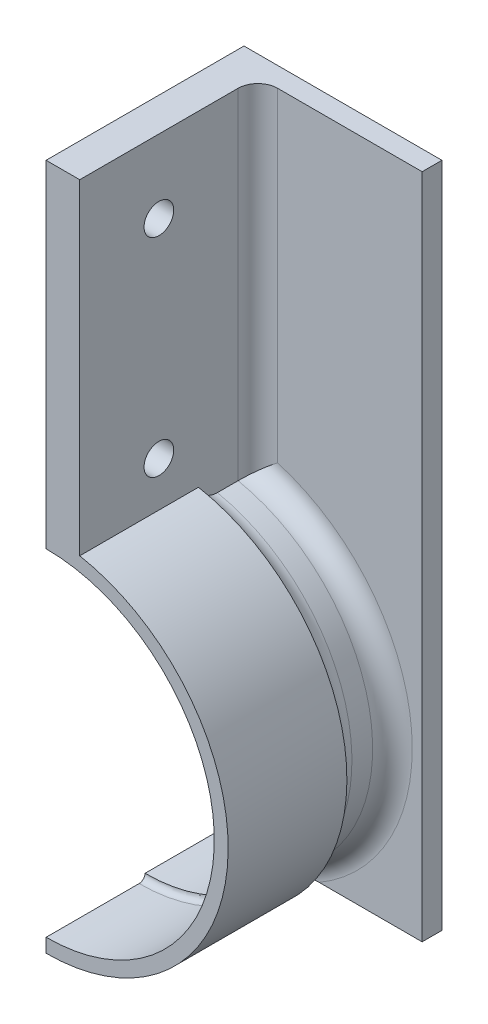
ISO-10303-21;
HEADER;
FILE_DESCRIPTION(('STEP AP214'),'2;1');
FILE_NAME('part.step','',(''),(''),'','','');
FILE_SCHEMA(('AUTOMOTIVE_DESIGN { 1 0 10303 214 1 1 1 1 }'));
ENDSEC;
DATA;
#1=APPLICATION_CONTEXT('core data for automotive mechanical design processes');
#2=APPLICATION_PROTOCOL_DEFINITION('international standard','automotive_design',2000,#1);
#3=PRODUCT_CONTEXT('',#1,'mechanical');
#4=PRODUCT('Part','Part','',(#3));
#5=PRODUCT_RELATED_PRODUCT_CATEGORY('part','',(#4));
#6=PRODUCT_DEFINITION_FORMATION('','',#4);
#7=PRODUCT_DEFINITION_CONTEXT('part definition',#1,'design');
#8=PRODUCT_DEFINITION('design','',#6,#7);
#9=PRODUCT_DEFINITION_SHAPE('','',#8);
#10=(LENGTH_UNIT() NAMED_UNIT(*) SI_UNIT(.MILLI.,.METRE.));
#11=(NAMED_UNIT(*) PLANE_ANGLE_UNIT() SI_UNIT($,.RADIAN.));
#12=(NAMED_UNIT(*) SI_UNIT($,.STERADIAN.) SOLID_ANGLE_UNIT());
#13=UNCERTAINTY_MEASURE_WITH_UNIT(LENGTH_MEASURE(1.E-05),#10,'distance_accuracy_value','');
#14=(GEOMETRIC_REPRESENTATION_CONTEXT(3) GLOBAL_UNCERTAINTY_ASSIGNED_CONTEXT((#13)) GLOBAL_UNIT_ASSIGNED_CONTEXT((#10,
#11,#12)) REPRESENTATION_CONTEXT('',''));
#15=CARTESIAN_POINT('',(0.,0.,0.));
#16=DIRECTION('',(0.,0.,1.));
#17=DIRECTION('',(1.,0.,0.));
#18=AXIS2_PLACEMENT_3D('',#15,#16,#17);
#19=CARTESIAN_POINT('',(25.4,20.828,12.7));
#20=DIRECTION('',(0.,0.,-1.));
#21=DIRECTION('',(-1.,0.,0.));
#22=AXIS2_PLACEMENT_3D('',#19,#20,#21);
#23=CYLINDRICAL_SURFACE('',#22,21.59);
#24=DIRECTION('',(0.,0.,-1.));
#25=VECTOR('',#24,1.);
#26=CARTESIAN_POINT('',(29.718,41.9817934186755,25.4));
#27=LINE('',#26,#25);
#28=CARTESIAN_POINT('',(29.718,41.9817934186755,7.73699442840096));
#29=VERTEX_POINT('',#28);
#30=CARTESIAN_POINT('',(29.718,41.9817934186755,5.08));
#31=VERTEX_POINT('',#30);
#32=EDGE_CURVE('E188',#29,#31,#27,.T.);
#33=ORIENTED_EDGE('',*,*,#32,.F.);
#34=CARTESIAN_POINT('',(25.4,20.828,7.73699442840096));
#35=DIRECTION('',(0.,0.,1.));
#36=DIRECTION('',(1.,0.,0.));
#37=AXIS2_PLACEMENT_3D('',#34,#35,#36);
#38=CIRCLE('',#37,21.59);
#39=CARTESIAN_POINT('',(25.4,-0.762000000000009,7.73699442840096));
#40=VERTEX_POINT('',#39);
#41=EDGE_CURVE('E360',#29,#40,#38,.F.);
#42=ORIENTED_EDGE('',*,*,#41,.T.);
#43=DIRECTION('',(0.,0.,-1.));
#44=VECTOR('',#43,1.);
#45=CARTESIAN_POINT('',(25.4,-0.762000000000009,12.7));
#46=LINE('',#45,#44);
#47=CARTESIAN_POINT('',(25.4,-0.762000000000009,0.));
#48=VERTEX_POINT('',#47);
#49=EDGE_CURVE('E234',#40,#48,#46,.T.);
#50=ORIENTED_EDGE('',*,*,#49,.T.);
#51=CARTESIAN_POINT('',(25.4,20.828,0.));
#52=DIRECTION('',(0.,0.,1.));
#53=DIRECTION('',(1.,0.,0.));
#54=AXIS2_PLACEMENT_3D('',#51,#52,#53);
#55=CIRCLE('',#54,21.59);
#56=CARTESIAN_POINT('',(31.0852894385423,0.,0.));
#57=VERTEX_POINT('',#56);
#58=EDGE_CURVE('E227',#48,#57,#55,.T.);
#59=ORIENTED_EDGE('',*,*,#58,.T.);
#60=DIRECTION('',(0.,0.,-1.));
#61=VECTOR('',#60,1.);
#62=CARTESIAN_POINT('',(31.0852894385423,0.,2.54));
#63=LINE('',#62,#61);
#64=CARTESIAN_POINT('',(31.0852894385423,0.,5.08));
#65=VERTEX_POINT('',#64);
#66=EDGE_CURVE('E269',#65,#57,#63,.T.);
#67=ORIENTED_EDGE('',*,*,#66,.F.);
#68=CARTESIAN_POINT('',(25.4,20.828,5.08));
#69=DIRECTION('',(0.,0.,1.));
#70=DIRECTION('',(1.,0.,0.));
#71=AXIS2_PLACEMENT_3D('',#68,#69,#70);
#72=CIRCLE('',#71,21.59);
#73=EDGE_CURVE('E273',#65,#31,#72,.T.);
#74=ORIENTED_EDGE('',*,*,#73,.T.);
#75=EDGE_LOOP('',(#33,#42,#50,#59,#67,#74));
#76=FACE_BOUND('',#75,.T.);
#77=ADVANCED_FACE('F57',(#76),#23,.T.);
#78=CARTESIAN_POINT('',(0.,0.,2.54));
#79=DIRECTION('',(0.,-1.,0.));
#80=DIRECTION('',(1.,0.,0.));
#81=AXIS2_PLACEMENT_3D('',#78,#79,#80);
#82=PLANE('',#81);
#83=DIRECTION('',(-1.,0.,0.));
#84=VECTOR('',#83,1.);
#85=CARTESIAN_POINT('',(0.,0.,0.));
#86=LINE('',#85,#84);
#87=CARTESIAN_POINT('',(50.8,0.,0.));
#88=VERTEX_POINT('',#87);
#89=EDGE_CURVE('E240',#88,#57,#86,.T.);
#90=ORIENTED_EDGE('',*,*,#89,.F.);
#91=DIRECTION('',(0.,0.,-1.));
#92=VECTOR('',#91,1.);
#93=CARTESIAN_POINT('',(50.8,0.,2.54));
#94=LINE('',#93,#92);
#95=CARTESIAN_POINT('',(50.8,0.,2.54));
#96=VERTEX_POINT('',#95);
#97=EDGE_CURVE('E266',#96,#88,#94,.T.);
#98=ORIENTED_EDGE('',*,*,#97,.F.);
#99=DIRECTION('',(-1.,0.,0.));
#100=VECTOR('',#99,1.);
#101=CARTESIAN_POINT('',(0.,0.,2.54));
#102=LINE('',#101,#100);
#103=CARTESIAN_POINT('',(37.5840599144949,0.,2.54));
#104=VERTEX_POINT('',#103);
#105=EDGE_CURVE('E241',#96,#104,#102,.T.);
#106=ORIENTED_EDGE('',*,*,#105,.T.);
#107=CARTESIAN_POINT('',(37.5840599144949,0.,2.54));
#108=CARTESIAN_POINT('',(37.4176967580642,0.,2.54002407059406));
#109=CARTESIAN_POINT('',(37.2513638373727,0.,2.54416675038596));
#110=CARTESIAN_POINT('',(36.9191081361267,0.,2.56010376706075));
#111=CARTESIAN_POINT('',(36.7531852521574,0.,2.57189592203051));
#112=CARTESIAN_POINT('',(36.4219315890537,0.,2.6025537166586));
#113=CARTESIAN_POINT('',(36.2566011009432,0.,2.62142245081183));
#114=CARTESIAN_POINT('',(35.92682549381,0.,2.66580794555206));
#115=CARTESIAN_POINT('',(35.7623804437359,0.,2.69132521642981));
#116=CARTESIAN_POINT('',(35.4348121931445,0.,2.74865144751826));
#117=CARTESIAN_POINT('',(35.2716875634179,0.,2.78045226543716));
#118=CARTESIAN_POINT('',(34.9467512718458,0.,2.85017426252131));
#119=CARTESIAN_POINT('',(34.7849396159099,0.,2.88809546921806));
#120=CARTESIAN_POINT('',(34.4629336873061,0.,2.96998801711861));
#121=CARTESIAN_POINT('',(34.3027387102494,0.,3.01395658947062));
#122=CARTESIAN_POINT('',(33.9841909007096,0.,3.10807656737236));
#123=CARTESIAN_POINT('',(33.8258378003098,0.,3.15822706108278));
#124=CARTESIAN_POINT('',(33.5844250848955,0.,3.24026866973817));
#125=CARTESIAN_POINT('',(33.5005652465513,0.,3.26981790499585));
#126=CARTESIAN_POINT('',(33.3335846097119,0.,3.33090396246121));
#127=CARTESIAN_POINT('',(33.2504637212044,0.,3.36244053869548));
#128=CARTESIAN_POINT('',(33.0022815550943,0.,3.46025636363336));
#129=CARTESIAN_POINT('',(32.8384583470845,0.,3.52972235975308));
#130=CARTESIAN_POINT('',(32.5251690534712,0.,3.67446124011205));
#131=CARTESIAN_POINT('',(32.3754315840688,0.,3.74913488757589));
#132=CARTESIAN_POINT('',(32.1558169775345,0.,3.87017218178491));
#133=CARTESIAN_POINT('',(32.0834527060279,0.,3.91201666854606));
#134=CARTESIAN_POINT('',(31.9409693386891,0.,3.99934858871018));
#135=CARTESIAN_POINT('',(31.8708494371806,0.,4.04483469385302));
#136=CARTESIAN_POINT('',(31.7268834921208,0.,4.14507892953177));
#137=CARTESIAN_POINT('',(31.6533628660681,0.,4.20030934335673));
#138=CARTESIAN_POINT('',(31.5121572191834,0.,4.31795298501494));
#139=CARTESIAN_POINT('',(31.4444684361928,0.,4.38036152058591));
#140=CARTESIAN_POINT('',(31.3410930380574,0.,4.49138892796041));
#141=CARTESIAN_POINT('',(31.3024712903756,0.,4.53724036643032));
#142=CARTESIAN_POINT('',(31.2317899237751,0.,4.63381573169035));
#143=CARTESIAN_POINT('',(31.1997190219209,0.,4.68453105580778));
#144=CARTESIAN_POINT('',(31.1532647560149,0.,4.77579606399541));
#145=CARTESIAN_POINT('',(31.136446559988,0.,4.8150900719681));
#146=CARTESIAN_POINT('',(31.1094202577423,0.,4.89585249420401));
#147=CARTESIAN_POINT('',(31.0991909168874,0.,4.93731345295458));
#148=CARTESIAN_POINT('',(31.0903577626122,0.,4.99597055913856));
#149=CARTESIAN_POINT('',(31.0884636901774,0.,5.01270652210177));
#150=CARTESIAN_POINT('',(31.0859279227728,0.,5.04629205028491));
#151=CARTESIAN_POINT('',(31.0852876630417,0.,5.06314172356526));
#152=CARTESIAN_POINT('',(31.0852894385431,0.,5.08000000000012));
#153=B_SPLINE_CURVE_WITH_KNOTS('',3,(#107,#108,#109,#110,#111,#112,#113,#114,#115,#116,#117,
#118,#119,#120,#121,#122,#123,#124,#125,#126,#127,#128,#129,#130,#131,#132,#133,#134,#135,#136,
#137,#138,#139,#140,#141,#142,#143,#144,#145,#146,#147,#148,#149,#150,#151,#152),.UNSPECIFIED.,
.F.,.F.,(4,2,2,2,2,2,2,2,2,2,2,2,2,2,2,2,2,2,2,2,2,2,4),(0.,0.498995224111989,0.997848178884856,
1.49691953031494,1.99602919792894,2.49449630558214,2.99296565556602,3.49120753106128,
3.98937600314549,4.2560946205508,4.52278029075546,5.05633363075435,5.5578456376388,
5.8085394726546,6.05914228146465,6.33472813099437,6.61013484598624,6.78962284467556,
6.96879904349882,7.09659100022738,7.22396901921171,7.27445756251079,7.32500386630806),.UNSPECIFIED.);
#154=EDGE_CURVE('E286',#104,#65,#153,.T.);
#155=ORIENTED_EDGE('',*,*,#154,.T.);
#156=ORIENTED_EDGE('',*,*,#66,.T.);
#157=EDGE_LOOP('',(#90,#98,#106,#155,#156));
#158=FACE_BOUND('',#157,.T.);
#159=ADVANCED_FACE('F301',(#158),#82,.T.);
#160=CARTESIAN_POINT('',(50.8,0.,2.54));
#161=DIRECTION('',(1.,0.,0.));
#162=DIRECTION('',(0.,1.,0.));
#163=AXIS2_PLACEMENT_3D('',#160,#161,#162);
#164=PLANE('',#163);
#165=DIRECTION('',(0.,-1.,0.));
#166=VECTOR('',#165,1.);
#167=CARTESIAN_POINT('',(50.8,0.,0.));
#168=LINE('',#167,#166);
#169=CARTESIAN_POINT('',(50.8,85.598,0.));
#170=VERTEX_POINT('',#169);
#171=EDGE_CURVE('E257',#170,#88,#168,.T.);
#172=ORIENTED_EDGE('',*,*,#171,.F.);
#173=DIRECTION('',(0.,0.,-1.));
#174=VECTOR('',#173,1.);
#175=CARTESIAN_POINT('',(50.8,85.598,2.54));
#176=LINE('',#175,#174);
#177=CARTESIAN_POINT('',(50.8,85.598,2.54));
#178=VERTEX_POINT('',#177);
#179=EDGE_CURVE('E253',#178,#170,#176,.T.);
#180=ORIENTED_EDGE('',*,*,#179,.F.);
#181=DIRECTION('',(0.,-1.,0.));
#182=VECTOR('',#181,1.);
#183=CARTESIAN_POINT('',(50.8,0.,2.54));
#184=LINE('',#183,#182);
#185=EDGE_CURVE('E245',#178,#96,#184,.T.);
#186=ORIENTED_EDGE('',*,*,#185,.T.);
#187=ORIENTED_EDGE('',*,*,#97,.T.);
#188=EDGE_LOOP('',(#172,#180,#186,#187));
#189=FACE_BOUND('',#188,.T.);
#190=ADVANCED_FACE('F305',(#189),#164,.T.);
#191=CARTESIAN_POINT('',(0.,85.598,2.54));
#192=DIRECTION('',(0.,1.,0.));
#193=DIRECTION('',(0.,0.,1.));
#194=AXIS2_PLACEMENT_3D('',#191,#192,#193);
#195=PLANE('',#194);
#196=DIRECTION('',(1.,0.,0.));
#197=VECTOR('',#196,1.);
#198=CARTESIAN_POINT('',(0.,85.598,0.));
#199=LINE('',#198,#197);
#200=CARTESIAN_POINT('',(25.4,85.598,0.));
#201=VERTEX_POINT('',#200);
#202=EDGE_CURVE('E246',#201,#170,#199,.T.);
#203=ORIENTED_EDGE('',*,*,#202,.F.);
#204=DIRECTION('',(0.,0.,-1.));
#205=VECTOR('',#204,1.);
#206=CARTESIAN_POINT('',(25.4,85.598,25.4));
#207=LINE('',#206,#205);
#208=CARTESIAN_POINT('',(25.4,85.598,25.4));
#209=VERTEX_POINT('',#208);
#210=EDGE_CURVE('E414',#209,#201,#207,.T.);
#211=ORIENTED_EDGE('',*,*,#210,.F.);
#212=DIRECTION('',(1.,0.,0.));
#213=VECTOR('',#212,1.);
#214=CARTESIAN_POINT('',(0.,85.598,25.4));
#215=LINE('',#214,#213);
#216=CARTESIAN_POINT('',(29.718,85.598,25.4));
#217=VERTEX_POINT('',#216);
#218=EDGE_CURVE('E178',#209,#217,#215,.T.);
#219=ORIENTED_EDGE('',*,*,#218,.T.);
#220=DIRECTION('',(0.,0.,-1.));
#221=VECTOR('',#220,1.);
#222=CARTESIAN_POINT('',(29.718,85.598,25.4));
#223=LINE('',#222,#221);
#224=CARTESIAN_POINT('',(29.718,85.598,5.08));
#225=VERTEX_POINT('',#224);
#226=EDGE_CURVE('E195',#217,#225,#223,.T.);
#227=ORIENTED_EDGE('',*,*,#226,.T.);
#228=CARTESIAN_POINT('',(32.258,85.598,5.08));
#229=DIRECTION('',(0.,1.,0.));
#230=DIRECTION('',(0.,0.,1.));
#231=AXIS2_PLACEMENT_3D('',#228,#229,#230);
#232=CIRCLE('',#231,2.54);
#233=CARTESIAN_POINT('',(32.258,85.598,2.54));
#234=VERTEX_POINT('',#233);
#235=EDGE_CURVE('E296',#225,#234,#232,.F.);
#236=ORIENTED_EDGE('',*,*,#235,.T.);
#237=DIRECTION('',(1.,0.,0.));
#238=VECTOR('',#237,1.);
#239=CARTESIAN_POINT('',(0.,85.598,2.54));
#240=LINE('',#239,#238);
#241=EDGE_CURVE('E250',#234,#178,#240,.T.);
#242=ORIENTED_EDGE('',*,*,#241,.T.);
#243=ORIENTED_EDGE('',*,*,#179,.T.);
#244=EDGE_LOOP('',(#203,#211,#219,#227,#236,#242,#243));
#245=FACE_BOUND('',#244,.T.);
#246=ADVANCED_FACE('F309',(#245),#195,.T.);
#247=CARTESIAN_POINT('',(0.,0.,2.54));
#248=DIRECTION('',(0.,0.,1.));
#249=DIRECTION('',(1.,0.,0.));
#250=AXIS2_PLACEMENT_3D('',#247,#248,#249);
#251=PLANE('',#250);
#252=DIRECTION('',(0.,-1.,0.));
#253=VECTOR('',#252,1.);
#254=CARTESIAN_POINT('',(32.258,41.9817934186755,2.54));
#255=LINE('',#254,#253);
#256=CARTESIAN_POINT('',(32.258,43.9629245946469,2.54));
#257=VERTEX_POINT('',#256);
#258=EDGE_CURVE('E277',#234,#257,#255,.T.);
#259=ORIENTED_EDGE('',*,*,#258,.T.);
#260=CARTESIAN_POINT('',(25.4,20.828,2.54));
#261=DIRECTION('',(0.,0.,1.));
#262=DIRECTION('',(1.,0.,0.));
#263=AXIS2_PLACEMENT_3D('',#260,#261,#262);
#264=CIRCLE('',#263,24.13);
#265=EDGE_CURVE('E280',#257,#104,#264,.F.);
#266=ORIENTED_EDGE('',*,*,#265,.T.);
#267=ORIENTED_EDGE('',*,*,#105,.F.);
#268=ORIENTED_EDGE('',*,*,#185,.F.);
#269=ORIENTED_EDGE('',*,*,#241,.F.);
#270=EDGE_LOOP('',(#259,#266,#267,#268,#269));
#271=FACE_BOUND('',#270,.T.);
#272=ADVANCED_FACE('F313',(#271),#251,.T.);
#273=CARTESIAN_POINT('',(0.,0.,0.));
#274=DIRECTION('',(0.,0.,1.));
#275=DIRECTION('',(1.,0.,0.));
#276=AXIS2_PLACEMENT_3D('',#273,#274,#275);
#277=PLANE('',#276);
#278=DIRECTION('',(0.,-1.,0.));
#279=VECTOR('',#278,1.);
#280=CARTESIAN_POINT('',(25.4,0.,0.));
#281=LINE('',#280,#279);
#282=CARTESIAN_POINT('',(25.4,41.656,0.));
#283=VERTEX_POINT('',#282);
#284=EDGE_CURVE('E219',#201,#283,#281,.T.);
#285=ORIENTED_EDGE('',*,*,#284,.F.);
#286=ORIENTED_EDGE('',*,*,#202,.T.);
#287=ORIENTED_EDGE('',*,*,#171,.T.);
#288=ORIENTED_EDGE('',*,*,#89,.T.);
#289=ORIENTED_EDGE('',*,*,#58,.F.);
#290=DIRECTION('',(0.,-1.,0.));
#291=VECTOR('',#290,1.);
#292=CARTESIAN_POINT('',(25.4,0.,0.));
#293=LINE('',#292,#291);
#294=CARTESIAN_POINT('',(25.4,0.,0.));
#295=VERTEX_POINT('',#294);
#296=EDGE_CURVE('E223',#295,#48,#293,.T.);
#297=ORIENTED_EDGE('',*,*,#296,.F.);
#298=CARTESIAN_POINT('',(25.4,20.828,0.));
#299=DIRECTION('',(0.,0.,1.));
#300=DIRECTION('',(1.,0.,0.));
#301=AXIS2_PLACEMENT_3D('',#298,#299,#300);
#302=CIRCLE('',#301,20.828);
#303=EDGE_CURVE('E213',#295,#283,#302,.T.);
#304=ORIENTED_EDGE('',*,*,#303,.T.);
#305=EDGE_LOOP('',(#285,#286,#287,#288,#289,#297,#304));
#306=FACE_BOUND('',#305,.T.);
#307=ADVANCED_FACE('F315',(#306),#277,.F.);
#308=CARTESIAN_POINT('',(25.4,20.828,12.7));
#309=DIRECTION('',(0.,0.,-1.));
#310=DIRECTION('',(-1.,0.,0.));
#311=AXIS2_PLACEMENT_3D('',#308,#309,#310);
#312=CYLINDRICAL_SURFACE('',#311,20.828);
#313=ORIENTED_EDGE('',*,*,#303,.F.);
#314=DIRECTION('',(0.,0.,-1.));
#315=VECTOR('',#314,1.);
#316=CARTESIAN_POINT('',(25.4,0.,12.7));
#317=LINE('',#316,#315);
#318=CARTESIAN_POINT('',(25.4,0.,12.7));
#319=VERTEX_POINT('',#318);
#320=EDGE_CURVE('E237',#319,#295,#317,.T.);
#321=ORIENTED_EDGE('',*,*,#320,.F.);
#322=CARTESIAN_POINT('',(25.4,20.828,12.7));
#323=DIRECTION('',(0.,0.,1.));
#324=DIRECTION('',(1.,0.,0.));
#325=AXIS2_PLACEMENT_3D('',#322,#323,#324);
#326=CIRCLE('',#325,20.828);
#327=CARTESIAN_POINT('',(25.4,41.656,12.7));
#328=VERTEX_POINT('',#327);
#329=EDGE_CURVE('E214',#319,#328,#326,.T.);
#330=ORIENTED_EDGE('',*,*,#329,.T.);
#331=DIRECTION('',(0.,0.,-1.));
#332=VECTOR('',#331,1.);
#333=CARTESIAN_POINT('',(25.4,41.656,12.7));
#334=LINE('',#333,#332);
#335=EDGE_CURVE('E218',#328,#283,#334,.T.);
#336=ORIENTED_EDGE('',*,*,#335,.T.);
#337=EDGE_LOOP('',(#313,#321,#330,#336));
#338=FACE_BOUND('',#337,.T.);
#339=ADVANCED_FACE('F318',(#338),#312,.F.);
#340=CARTESIAN_POINT('',(25.4,0.,12.7));
#341=DIRECTION('',(1.,0.,0.));
#342=DIRECTION('',(0.,1.,0.));
#343=AXIS2_PLACEMENT_3D('',#340,#341,#342);
#344=PLANE('',#343);
#345=ORIENTED_EDGE('',*,*,#296,.T.);
#346=ORIENTED_EDGE('',*,*,#49,.F.);
#347=CARTESIAN_POINT('',(25.4,-3.30200000000001,7.73699442840096));
#348=DIRECTION('',(1.,0.,0.));
#349=DIRECTION('',(0.,1.,0.));
#350=AXIS2_PLACEMENT_3D('',#347,#348,#349);
#351=CIRCLE('',#350,2.54);
#352=CARTESIAN_POINT('',(25.4,-2.54,10.16));
#353=VERTEX_POINT('',#352);
#354=EDGE_CURVE('E386',#40,#353,#351,.T.);
#355=ORIENTED_EDGE('',*,*,#354,.T.);
#356=DIRECTION('',(0.,0.,-1.));
#357=VECTOR('',#356,1.);
#358=CARTESIAN_POINT('',(25.4,-2.54,25.4));
#359=LINE('',#358,#357);
#360=CARTESIAN_POINT('',(25.4,-2.54,25.4));
#361=VERTEX_POINT('',#360);
#362=EDGE_CURVE('E209',#361,#353,#359,.T.);
#363=ORIENTED_EDGE('',*,*,#362,.F.);
#364=DIRECTION('',(0.,-1.,0.));
#365=VECTOR('',#364,1.);
#366=CARTESIAN_POINT('',(25.4,0.,25.4));
#367=LINE('',#366,#365);
#368=CARTESIAN_POINT('',(25.4,-0.762000000000009,25.4));
#369=VERTEX_POINT('',#368);
#370=EDGE_CURVE('E193',#369,#361,#367,.T.);
#371=ORIENTED_EDGE('',*,*,#370,.F.);
#372=DIRECTION('',(0.,0.,-1.));
#373=VECTOR('',#372,1.);
#374=CARTESIAN_POINT('',(25.4,-0.762000000000009,25.4));
#375=LINE('',#374,#373);
#376=CARTESIAN_POINT('',(25.4,-0.762000000000009,13.462));
#377=VERTEX_POINT('',#376);
#378=EDGE_CURVE('E165',#369,#377,#375,.T.);
#379=ORIENTED_EDGE('',*,*,#378,.T.);
#380=CARTESIAN_POINT('',(25.4,0.,13.462));
#381=DIRECTION('',(1.,0.,0.));
#382=DIRECTION('',(0.,1.,0.));
#383=AXIS2_PLACEMENT_3D('',#380,#381,#382);
#384=CIRCLE('',#383,0.762);
#385=EDGE_CURVE('E13',#377,#319,#384,.T.);
#386=ORIENTED_EDGE('',*,*,#385,.T.);
#387=ORIENTED_EDGE('',*,*,#320,.T.);
#388=EDGE_LOOP('',(#345,#346,#355,#363,#371,#379,#386,#387));
#389=FACE_BOUND('',#388,.T.);
#390=ADVANCED_FACE('F325',(#389),#344,.F.);
#391=CARTESIAN_POINT('',(25.4,0.,12.7));
#392=DIRECTION('',(1.,0.,0.));
#393=DIRECTION('',(0.,1.,0.));
#394=AXIS2_PLACEMENT_3D('',#391,#392,#393);
#395=PLANE('',#394);
#396=CARTESIAN_POINT('',(25.4,76.2,15.24));
#397=DIRECTION('',(1.,0.,0.));
#398=DIRECTION('',(0.,1.,0.));
#399=AXIS2_PLACEMENT_3D('',#396,#397,#398);
#400=CIRCLE('',#399,1.905);
#401=CARTESIAN_POINT('',(25.4,76.2,17.145));
#402=VERTEX_POINT('',#401);
#403=EDGE_CURVE('E404',#402,#402,#400,.F.);
#404=ORIENTED_EDGE('',*,*,#403,.F.);
#405=EDGE_LOOP('',(#404));
#406=FACE_BOUND('',#405,.T.);
#407=CARTESIAN_POINT('',(25.4,49.53,15.24));
#408=DIRECTION('',(1.,0.,0.));
#409=DIRECTION('',(0.,1.,0.));
#410=AXIS2_PLACEMENT_3D('',#407,#408,#409);
#411=CIRCLE('',#410,1.905);
#412=CARTESIAN_POINT('',(25.4,49.53,17.145));
#413=VERTEX_POINT('',#412);
#414=EDGE_CURVE('E394',#413,#413,#411,.F.);
#415=ORIENTED_EDGE('',*,*,#414,.F.);
#416=EDGE_LOOP('',(#415));
#417=FACE_BOUND('',#416,.T.);
#418=ORIENTED_EDGE('',*,*,#284,.T.);
#419=ORIENTED_EDGE('',*,*,#335,.F.);
#420=CARTESIAN_POINT('',(25.4,41.656,13.462));
#421=DIRECTION('',(1.,0.,0.));
#422=DIRECTION('',(0.,1.,0.));
#423=AXIS2_PLACEMENT_3D('',#420,#421,#422);
#424=CIRCLE('',#423,0.762);
#425=CARTESIAN_POINT('',(25.4,42.418,13.462));
#426=VERTEX_POINT('',#425);
#427=EDGE_CURVE('E67',#328,#426,#424,.T.);
#428=ORIENTED_EDGE('',*,*,#427,.T.);
#429=DIRECTION('',(0.,0.,-1.));
#430=VECTOR('',#429,1.);
#431=CARTESIAN_POINT('',(25.4,42.418,25.4));
#432=LINE('',#431,#430);
#433=CARTESIAN_POINT('',(25.4,42.418,25.4));
#434=VERTEX_POINT('',#433);
#435=EDGE_CURVE('E164',#434,#426,#432,.T.);
#436=ORIENTED_EDGE('',*,*,#435,.F.);
#437=DIRECTION('',(0.,-1.,0.));
#438=VECTOR('',#437,1.);
#439=CARTESIAN_POINT('',(25.4,0.,25.4));
#440=LINE('',#439,#438);
#441=EDGE_CURVE('E174',#209,#434,#440,.T.);
#442=ORIENTED_EDGE('',*,*,#441,.F.);
#443=ORIENTED_EDGE('',*,*,#210,.T.);
#444=EDGE_LOOP('',(#418,#419,#428,#436,#442,#443));
#445=FACE_BOUND('',#444,.T.);
#446=ADVANCED_FACE('F185',(#406,#417,#445),#395,.F.);
#447=CARTESIAN_POINT('',(25.4,20.828,25.4));
#448=DIRECTION('',(0.,0.,-1.));
#449=DIRECTION('',(-1.,0.,0.));
#450=AXIS2_PLACEMENT_3D('',#447,#448,#449);
#451=CYLINDRICAL_SURFACE('',#450,23.368);
#452=CARTESIAN_POINT('',(25.4,20.828,10.16));
#453=DIRECTION('',(0.,0.,1.));
#454=DIRECTION('',(1.,0.,0.));
#455=AXIS2_PLACEMENT_3D('',#452,#453,#454);
#456=CIRCLE('',#455,23.368);
#457=CARTESIAN_POINT('',(29.718,43.7935894764319,10.16));
#458=VERTEX_POINT('',#457);
#459=EDGE_CURVE('E187',#353,#458,#456,.T.);
#460=ORIENTED_EDGE('',*,*,#459,.T.);
#461=DIRECTION('',(0.,0.,-1.));
#462=VECTOR('',#461,1.);
#463=CARTESIAN_POINT('',(29.718,43.7935894764319,25.4));
#464=LINE('',#463,#462);
#465=CARTESIAN_POINT('',(29.718,43.7935894764319,25.4));
#466=VERTEX_POINT('',#465);
#467=EDGE_CURVE('E205',#466,#458,#464,.T.);
#468=ORIENTED_EDGE('',*,*,#467,.F.);
#469=CARTESIAN_POINT('',(25.4,20.828,25.4));
#470=DIRECTION('',(0.,0.,1.));
#471=DIRECTION('',(1.,0.,0.));
#472=AXIS2_PLACEMENT_3D('',#469,#470,#471);
#473=CIRCLE('',#472,23.368);
#474=EDGE_CURVE('E170',#361,#466,#473,.T.);
#475=ORIENTED_EDGE('',*,*,#474,.F.);
#476=ORIENTED_EDGE('',*,*,#362,.T.);
#477=EDGE_LOOP('',(#460,#468,#475,#476));
#478=FACE_BOUND('',#477,.T.);
#479=ADVANCED_FACE('F335',(#478),#451,.T.);
#480=CARTESIAN_POINT('',(25.4,20.828,25.4));
#481=DIRECTION('',(0.,0.,-1.));
#482=DIRECTION('',(-1.,0.,0.));
#483=AXIS2_PLACEMENT_3D('',#480,#481,#482);
#484=CYLINDRICAL_SURFACE('',#483,21.59);
#485=ORIENTED_EDGE('',*,*,#435,.T.);
#486=CARTESIAN_POINT('',(25.4,20.828,13.462));
#487=DIRECTION('',(0.,0.,1.));
#488=DIRECTION('',(1.,0.,0.));
#489=AXIS2_PLACEMENT_3D('',#486,#487,#488);
#490=CIRCLE('',#489,21.59);
#491=EDGE_CURVE('E75',#426,#377,#490,.F.);
#492=ORIENTED_EDGE('',*,*,#491,.T.);
#493=ORIENTED_EDGE('',*,*,#378,.F.);
#494=CARTESIAN_POINT('',(25.4,20.828,25.4));
#495=DIRECTION('',(0.,0.,1.));
#496=DIRECTION('',(1.,0.,0.));
#497=AXIS2_PLACEMENT_3D('',#494,#495,#496);
#498=CIRCLE('',#497,21.59);
#499=EDGE_CURVE('E161',#369,#434,#498,.T.);
#500=ORIENTED_EDGE('',*,*,#499,.T.);
#501=EDGE_LOOP('',(#485,#492,#493,#500));
#502=FACE_BOUND('',#501,.T.);
#503=ADVANCED_FACE('F163',(#502),#484,.F.);
#504=CARTESIAN_POINT('',(0.,0.,25.4));
#505=DIRECTION('',(0.,0.,1.));
#506=DIRECTION('',(1.,0.,0.));
#507=AXIS2_PLACEMENT_3D('',#504,#505,#506);
#508=PLANE('',#507);
#509=ORIENTED_EDGE('',*,*,#370,.T.);
#510=ORIENTED_EDGE('',*,*,#474,.T.);
#511=DIRECTION('',(0.,-1.,0.));
#512=VECTOR('',#511,1.);
#513=CARTESIAN_POINT('',(29.718,0.,25.4));
#514=LINE('',#513,#512);
#515=EDGE_CURVE('E181',#217,#466,#514,.T.);
#516=ORIENTED_EDGE('',*,*,#515,.F.);
#517=ORIENTED_EDGE('',*,*,#218,.F.);
#518=ORIENTED_EDGE('',*,*,#441,.T.);
#519=ORIENTED_EDGE('',*,*,#499,.F.);
#520=EDGE_LOOP('',(#509,#510,#516,#517,#518,#519));
#521=FACE_BOUND('',#520,.T.);
#522=ADVANCED_FACE('F175',(#521),#508,.T.);
#523=CARTESIAN_POINT('',(29.718,0.,25.4));
#524=DIRECTION('',(1.,0.,0.));
#525=DIRECTION('',(0.,1.,0.));
#526=AXIS2_PLACEMENT_3D('',#523,#524,#525);
#527=PLANE('',#526);
#528=CARTESIAN_POINT('',(29.718,76.2,15.24));
#529=DIRECTION('',(1.,0.,0.));
#530=DIRECTION('',(0.,1.,0.));
#531=AXIS2_PLACEMENT_3D('',#528,#529,#530);
#532=CIRCLE('',#531,1.905);
#533=CARTESIAN_POINT('',(29.718,76.2,17.145));
#534=VERTEX_POINT('',#533);
#535=EDGE_CURVE('E61',#534,#534,#532,.F.);
#536=ORIENTED_EDGE('',*,*,#535,.T.);
#537=EDGE_LOOP('',(#536));
#538=FACE_BOUND('',#537,.T.);
#539=CARTESIAN_POINT('',(29.718,49.53,15.24));
#540=DIRECTION('',(1.,0.,0.));
#541=DIRECTION('',(0.,1.,0.));
#542=AXIS2_PLACEMENT_3D('',#539,#540,#541);
#543=CIRCLE('',#542,1.905);
#544=CARTESIAN_POINT('',(29.718,49.53,17.145));
#545=VERTEX_POINT('',#544);
#546=EDGE_CURVE('E391',#545,#545,#543,.F.);
#547=ORIENTED_EDGE('',*,*,#546,.T.);
#548=EDGE_LOOP('',(#547));
#549=FACE_BOUND('',#548,.T.);
#550=ORIENTED_EDGE('',*,*,#467,.T.);
#551=CARTESIAN_POINT('',(29.718,43.7935894764319,10.16));
#552=CARTESIAN_POINT('',(29.718,43.7238341165531,10.1384394505341));
#553=CARTESIAN_POINT('',(29.718,43.6550120300066,10.1139740655779));
#554=CARTESIAN_POINT('',(29.718,43.5196517108299,10.0593778736427));
#555=CARTESIAN_POINT('',(29.718,43.4531135238361,10.0292469535344));
#556=CARTESIAN_POINT('',(29.718,43.2576496789117,9.93062154828261));
#557=CARTESIAN_POINT('',(29.718,43.1327721346057,9.85386265375129));
#558=CARTESIAN_POINT('',(29.718,42.8976969763385,9.68038101166567));
#559=CARTESIAN_POINT('',(29.718,42.7875099915996,9.5836439366946));
#560=CARTESIAN_POINT('',(29.718,42.5852111418281,9.37285926301665));
#561=CARTESIAN_POINT('',(29.718,42.4930913640704,9.25881928128868));
#562=CARTESIAN_POINT('',(29.718,42.3307735875437,9.01806266937681));
#563=CARTESIAN_POINT('',(29.718,42.2603282137493,8.89151269029474));
#564=CARTESIAN_POINT('',(29.718,42.1421550946068,8.62820120245537));
#565=CARTESIAN_POINT('',(29.718,42.0944203859385,8.4914428385899));
#566=CARTESIAN_POINT('',(29.718,42.0332859484736,8.25127176642006));
#567=CARTESIAN_POINT('',(29.718,42.0140022580866,8.14931674197904));
#568=CARTESIAN_POINT('',(29.718,41.9882494253367,7.943921420764));
#569=CARTESIAN_POINT('',(29.718,41.9817655800415,7.84048296577162));
#570=CARTESIAN_POINT('',(29.718,41.9817934186755,7.73699442840096));
#571=B_SPLINE_CURVE_WITH_KNOTS('',3,(#551,#552,#553,#554,#555,#556,#557,#558,#559,#560,#561,
#562,#563,#564,#565,#566,#567,#568,#569,#570),.UNSPECIFIED.,.F.,.F.,(4,2,2,2,2,2,2,2,2,4),(0.,
0.21890247766688,0.437809326841313,0.875304854379786,1.31311522960884,1.75073343085556,
2.18315393515923,2.61544176936976,2.92596688046582,3.23613508939136),.UNSPECIFIED.);
#572=EDGE_CURVE('E353',#458,#29,#571,.T.);
#573=ORIENTED_EDGE('',*,*,#572,.T.);
#574=ORIENTED_EDGE('',*,*,#32,.T.);
#575=DIRECTION('',(0.,-1.,0.));
#576=VECTOR('',#575,1.);
#577=CARTESIAN_POINT('',(29.718,85.598,5.08));
#578=LINE('',#577,#576);
#579=EDGE_CURVE('E283',#31,#225,#578,.F.);
#580=ORIENTED_EDGE('',*,*,#579,.T.);
#581=ORIENTED_EDGE('',*,*,#226,.F.);
#582=ORIENTED_EDGE('',*,*,#515,.T.);
#583=EDGE_LOOP('',(#550,#573,#574,#580,#581,#582));
#584=FACE_BOUND('',#583,.T.);
#585=ADVANCED_FACE('F344',(#538,#549,#584),#527,.T.);
#586=CARTESIAN_POINT('',(32.258,0.,5.08));
#587=DIRECTION('',(0.,1.,0.));
#588=DIRECTION('',(-1.,0.,0.));
#589=AXIS2_PLACEMENT_3D('',#586,#587,#588);
#590=CYLINDRICAL_SURFACE('',#589,2.54);
#591=ORIENTED_EDGE('',*,*,#235,.F.);
#592=ORIENTED_EDGE('',*,*,#579,.F.);
#593=CARTESIAN_POINT('',(29.718,41.9817934186755,5.08));
#594=CARTESIAN_POINT('',(29.7179868525976,41.981781790478,5.01965116827999));
#595=CARTESIAN_POINT('',(29.7201503545004,41.9835491562669,4.9593115777802));
#596=CARTESIAN_POINT('',(29.7287294639266,41.9905527021619,4.83917343205825));
#597=CARTESIAN_POINT('',(29.7351425115944,41.9957867939693,4.7793745730768));
#598=CARTESIAN_POINT('',(29.7520609866859,42.0095868889027,4.66117711863565));
#599=CARTESIAN_POINT('',(29.762537780526,42.0181295786837,4.60277169591608));
#600=CARTESIAN_POINT('',(29.7873970452975,42.0383826027662,4.48737004851407));
#601=CARTESIAN_POINT('',(29.8017799278194,42.0500932708819,4.43037397302764));
#602=CARTESIAN_POINT('',(29.8503998738406,42.0896390212473,4.26231774671221));
#603=CARTESIAN_POINT('',(29.8901613840319,42.1219313703917,4.15383074717146));
#604=CARTESIAN_POINT('',(29.9823266012153,42.1965578433487,3.94602450485301));
#605=CARTESIAN_POINT('',(30.0347532842992,42.2389102148416,3.84672238250497));
#606=CARTESIAN_POINT('',(30.1687587108149,42.3467763154654,3.62811318456658));
#607=CARTESIAN_POINT('',(30.2542817806886,42.4153506553911,3.51272479171881));
#608=CARTESIAN_POINT('',(30.4392485365705,42.5628394863352,3.30136341188983));
#609=CARTESIAN_POINT('',(30.5387144641815,42.6417704851376,3.20542205690691));
#610=CARTESIAN_POINT('',(30.7741887251051,42.8275129084563,3.01151863236241));
#611=CARTESIAN_POINT('',(30.9131137400419,42.9363592327673,2.91905572106407));
#612=CARTESIAN_POINT('',(31.2017741118868,43.1607355784742,2.76421997714121));
#613=CARTESIAN_POINT('',(31.351514141322,43.2762684844113,2.70186024080032));
#614=CARTESIAN_POINT('',(31.625886878151,43.4862807619923,2.61663080498414));
#615=CARTESIAN_POINT('',(31.7493111506839,43.5801754113286,2.58826264444268));
#616=CARTESIAN_POINT('',(31.9983544997082,43.7684526654653,2.55017759076966));
#617=CARTESIAN_POINT('',(32.12396846743,43.8628338459796,2.54042196008685));
#618=CARTESIAN_POINT('',(32.2525009366138,43.9588188495121,2.54000446260977));
#619=CARTESIAN_POINT('',(32.2552504334122,43.9608718335589,2.53999999792227));
#620=CARTESIAN_POINT('',(32.258,43.9629245946469,2.54));
#621=B_SPLINE_CURVE_WITH_KNOTS('',3,(#593,#594,#595,#596,#597,#598,#599,#600,#601,#602,#603,
#604,#605,#606,#607,#608,#609,#610,#611,#612,#613,#614,#615,#616,#617,#618,#619,#620),
.UNSPECIFIED.,.F.,.F.,(4,2,2,2,2,2,2,2,2,2,2,2,2,4),(0.,0.18096671126668,0.361824510181028,
0.541430460908171,0.721055344339483,1.0792233224743,1.43804600365724,1.91293236744368,
2.38858507655304,2.98323376812747,3.5781409269643,4.05007282115772,4.52102142536176,
4.53131560728989),.UNSPECIFIED.);
#622=EDGE_CURVE('E182',#257,#31,#621,.F.);
#623=ORIENTED_EDGE('',*,*,#622,.F.);
#624=ORIENTED_EDGE('',*,*,#258,.F.);
#625=EDGE_LOOP('',(#591,#592,#623,#624));
#626=FACE_BOUND('',#625,.T.);
#627=ADVANCED_FACE('F348',(#626),#590,.F.);
#628=CARTESIAN_POINT('',(25.4,20.828,5.08));
#629=DIRECTION('',(0.,0.,1.));
#630=DIRECTION('',(1.,0.,0.));
#631=AXIS2_PLACEMENT_3D('',#628,#629,#630);
#632=TOROIDAL_SURFACE('',#631,24.13,2.54);
#633=ORIENTED_EDGE('',*,*,#154,.F.);
#634=ORIENTED_EDGE('',*,*,#265,.F.);
#635=ORIENTED_EDGE('',*,*,#622,.T.);
#636=ORIENTED_EDGE('',*,*,#73,.F.);
#637=EDGE_LOOP('',(#633,#634,#635,#636));
#638=FACE_BOUND('',#637,.T.);
#639=ADVANCED_FACE('F298',(#638),#632,.F.);
#640=CARTESIAN_POINT('',(25.4,20.828,7.73699442840096));
#641=DIRECTION('',(0.,0.,1.));
#642=DIRECTION('',(1.,0.,0.));
#643=AXIS2_PLACEMENT_3D('',#640,#641,#642);
#644=TOROIDAL_SURFACE('',#643,24.13,2.54);
#645=ORIENTED_EDGE('',*,*,#354,.F.);
#646=ORIENTED_EDGE('',*,*,#41,.F.);
#647=ORIENTED_EDGE('',*,*,#572,.F.);
#648=ORIENTED_EDGE('',*,*,#459,.F.);
#649=EDGE_LOOP('',(#645,#646,#647,#648));
#650=FACE_BOUND('',#649,.T.);
#651=ADVANCED_FACE('F366',(#650),#644,.F.);
#652=CARTESIAN_POINT('',(25.4,20.828,13.462));
#653=DIRECTION('',(0.,0.,1.));
#654=DIRECTION('',(1.,0.,0.));
#655=AXIS2_PLACEMENT_3D('',#652,#653,#654);
#656=TOROIDAL_SURFACE('',#655,20.828,0.762);
#657=ORIENTED_EDGE('',*,*,#385,.F.);
#658=ORIENTED_EDGE('',*,*,#491,.F.);
#659=ORIENTED_EDGE('',*,*,#427,.F.);
#660=ORIENTED_EDGE('',*,*,#329,.F.);
#661=EDGE_LOOP('',(#657,#658,#659,#660));
#662=FACE_BOUND('',#661,.T.);
#663=ADVANCED_FACE('F59',(#662),#656,.F.);
#664=CARTESIAN_POINT('',(50.8,49.53,15.24));
#665=DIRECTION('',(-1.,0.,0.));
#666=DIRECTION('',(0.,0.,1.));
#667=AXIS2_PLACEMENT_3D('',#664,#665,#666);
#668=CYLINDRICAL_SURFACE('',#667,1.905);
#669=CARTESIAN_POINT('',(29.718,49.53,17.145));
#670=CARTESIAN_POINT('',(29.6730208333333,49.53,17.145));
#671=CARTESIAN_POINT('',(29.6280416666667,49.53,17.145));
#672=CARTESIAN_POINT('',(29.5380833333333,49.53,17.145));
#673=CARTESIAN_POINT('',(29.4931041666667,49.53,17.145));
#674=CARTESIAN_POINT('',(29.4031458333333,49.53,17.145));
#675=CARTESIAN_POINT('',(29.3581666666667,49.53,17.145));
#676=CARTESIAN_POINT('',(29.2682083333333,49.53,17.145));
#677=CARTESIAN_POINT('',(29.2232291666667,49.53,17.145));
#678=CARTESIAN_POINT('',(29.1332708333333,49.53,17.145));
#679=CARTESIAN_POINT('',(29.0882916666667,49.53,17.145));
#680=CARTESIAN_POINT('',(28.9983333333333,49.53,17.145));
#681=CARTESIAN_POINT('',(28.9533541666667,49.53,17.145));
#682=CARTESIAN_POINT('',(28.8633958333333,49.53,17.145));
#683=CARTESIAN_POINT('',(28.8184166666667,49.53,17.145));
#684=CARTESIAN_POINT('',(28.7284583333333,49.53,17.145));
#685=CARTESIAN_POINT('',(28.6834791666667,49.53,17.145));
#686=CARTESIAN_POINT('',(28.5935208333333,49.53,17.145));
#687=CARTESIAN_POINT('',(28.5485416666667,49.53,17.145));
#688=CARTESIAN_POINT('',(28.4585833333333,49.53,17.145));
#689=CARTESIAN_POINT('',(28.4136041666667,49.53,17.145));
#690=CARTESIAN_POINT('',(28.3236458333333,49.53,17.145));
#691=CARTESIAN_POINT('',(28.2786666666667,49.53,17.145));
#692=CARTESIAN_POINT('',(28.1887083333333,49.53,17.145));
#693=CARTESIAN_POINT('',(28.1437291666667,49.53,17.145));
#694=CARTESIAN_POINT('',(28.0537708333333,49.53,17.145));
#695=CARTESIAN_POINT('',(28.0087916666667,49.53,17.145));
#696=CARTESIAN_POINT('',(27.9188333333333,49.53,17.145));
#697=CARTESIAN_POINT('',(27.8738541666667,49.53,17.145));
#698=CARTESIAN_POINT('',(27.7838958333333,49.53,17.145));
#699=CARTESIAN_POINT('',(27.7389166666667,49.53,17.145));
#700=CARTESIAN_POINT('',(27.6489583333333,49.53,17.145));
#701=CARTESIAN_POINT('',(27.6039791666667,49.53,17.145));
#702=CARTESIAN_POINT('',(27.5140208333333,49.53,17.145));
#703=CARTESIAN_POINT('',(27.4690416666667,49.53,17.145));
#704=CARTESIAN_POINT('',(27.3790833333333,49.53,17.145));
#705=CARTESIAN_POINT('',(27.3341041666667,49.53,17.145));
#706=CARTESIAN_POINT('',(27.2441458333333,49.53,17.145));
#707=CARTESIAN_POINT('',(27.1991666666667,49.53,17.145));
#708=CARTESIAN_POINT('',(27.1092083333333,49.53,17.145));
#709=CARTESIAN_POINT('',(27.0642291666667,49.53,17.145));
#710=CARTESIAN_POINT('',(26.9742708333333,49.53,17.145));
#711=CARTESIAN_POINT('',(26.9292916666667,49.53,17.145));
#712=CARTESIAN_POINT('',(26.8393333333333,49.53,17.145));
#713=CARTESIAN_POINT('',(26.7943541666667,49.53,17.145));
#714=CARTESIAN_POINT('',(26.7043958333333,49.53,17.145));
#715=CARTESIAN_POINT('',(26.6594166666667,49.53,17.145));
#716=CARTESIAN_POINT('',(26.5694583333333,49.53,17.145));
#717=CARTESIAN_POINT('',(26.5244791666667,49.53,17.145));
#718=CARTESIAN_POINT('',(26.4345208333333,49.53,17.145));
#719=CARTESIAN_POINT('',(26.3895416666667,49.53,17.145));
#720=CARTESIAN_POINT('',(26.2995833333333,49.53,17.145));
#721=CARTESIAN_POINT('',(26.2546041666667,49.53,17.145));
#722=CARTESIAN_POINT('',(26.1646458333333,49.53,17.145));
#723=CARTESIAN_POINT('',(26.1196666666667,49.53,17.145));
#724=CARTESIAN_POINT('',(26.0297083333333,49.53,17.145));
#725=CARTESIAN_POINT('',(25.9847291666667,49.53,17.145));
#726=CARTESIAN_POINT('',(25.8947708333333,49.53,17.145));
#727=CARTESIAN_POINT('',(25.8497916666667,49.53,17.145));
#728=CARTESIAN_POINT('',(25.7598333333333,49.53,17.145));
#729=CARTESIAN_POINT('',(25.7148541666667,49.53,17.145));
#730=CARTESIAN_POINT('',(25.6248958333333,49.53,17.145));
#731=CARTESIAN_POINT('',(25.5799166666667,49.53,17.145));
#732=CARTESIAN_POINT('',(25.4899583333333,49.53,17.145));
#733=CARTESIAN_POINT('',(25.4449791666667,49.53,17.145));
#734=CARTESIAN_POINT('',(25.4,49.53,17.145));
#735=B_SPLINE_CURVE_WITH_KNOTS('',3,(#669,#670,#671,#672,#673,#674,#675,#676,#677,#678,#679,
#680,#681,#682,#683,#684,#685,#686,#687,#688,#689,#690,#691,#692,#693,#694,#695,#696,#697,#698,
#699,#700,#701,#702,#703,#704,#705,#706,#707,#708,#709,#710,#711,#712,#713,#714,#715,#716,#717,
#718,#719,#720,#721,#722,#723,#724,#725,#726,#727,#728,#729,#730,#731,#732,#733,#734),
.UNSPECIFIED.,.F.,.F.,(4,2,2,2,2,2,2,2,2,2,2,2,2,2,2,2,2,2,2,2,2,2,2,2,2,2,2,2,2,2,2,2,4),(0.,
0.134937500000001,0.269874999999999,0.404812500000001,0.539749999999999,0.6746875,
0.809625000000001,0.944562499999999,1.0795,1.2144375,1.349375,1.4843125,1.61925,1.7541875,
1.889125,2.0240625,2.159,2.2939375,2.428875,2.5638125,2.69875,2.8336875,2.968625,3.1035625,
3.2385,3.3734375,3.508375,3.6433125,3.77825,3.9131875,4.048125,4.1830625,4.318),.UNSPECIFIED.);
#736=EDGE_CURVE('BSEAM350',#545,#413,#735,.T.);
#737=ORIENTED_EDGE('',*,*,#546,.F.);
#738=ORIENTED_EDGE('',*,*,#414,.T.);
#739=ORIENTED_EDGE('',*,*,#736,.T.);
#740=ORIENTED_EDGE('',*,*,#736,.F.);
#741=EDGE_LOOP('',(#737,#739,#738,#740));
#742=FACE_BOUND('',#741,.T.);
#743=ADVANCED_FACE('F350',(#742),#668,.F.);
#744=CARTESIAN_POINT('',(50.8,76.2,15.24));
#745=DIRECTION('',(-1.,0.,0.));
#746=DIRECTION('',(0.,0.,1.));
#747=AXIS2_PLACEMENT_3D('',#744,#745,#746);
#748=CYLINDRICAL_SURFACE('',#747,1.905);
#749=CARTESIAN_POINT('',(29.718,76.2,17.145));
#750=CARTESIAN_POINT('',(29.6730208333333,76.2,17.145));
#751=CARTESIAN_POINT('',(29.6280416666667,76.2,17.145));
#752=CARTESIAN_POINT('',(29.5380833333333,76.2,17.145));
#753=CARTESIAN_POINT('',(29.4931041666667,76.2,17.145));
#754=CARTESIAN_POINT('',(29.4031458333333,76.2,17.145));
#755=CARTESIAN_POINT('',(29.3581666666667,76.2,17.145));
#756=CARTESIAN_POINT('',(29.2682083333333,76.2,17.145));
#757=CARTESIAN_POINT('',(29.2232291666667,76.2,17.145));
#758=CARTESIAN_POINT('',(29.1332708333333,76.2,17.145));
#759=CARTESIAN_POINT('',(29.0882916666667,76.2,17.145));
#760=CARTESIAN_POINT('',(28.9983333333333,76.2,17.145));
#761=CARTESIAN_POINT('',(28.9533541666667,76.2,17.145));
#762=CARTESIAN_POINT('',(28.8633958333333,76.2,17.145));
#763=CARTESIAN_POINT('',(28.8184166666667,76.2,17.145));
#764=CARTESIAN_POINT('',(28.7284583333333,76.2,17.145));
#765=CARTESIAN_POINT('',(28.6834791666667,76.2,17.145));
#766=CARTESIAN_POINT('',(28.5935208333333,76.2,17.145));
#767=CARTESIAN_POINT('',(28.5485416666667,76.2,17.145));
#768=CARTESIAN_POINT('',(28.4585833333333,76.2,17.145));
#769=CARTESIAN_POINT('',(28.4136041666667,76.2,17.145));
#770=CARTESIAN_POINT('',(28.3236458333333,76.2,17.145));
#771=CARTESIAN_POINT('',(28.2786666666667,76.2,17.145));
#772=CARTESIAN_POINT('',(28.1887083333333,76.2,17.145));
#773=CARTESIAN_POINT('',(28.1437291666667,76.2,17.145));
#774=CARTESIAN_POINT('',(28.0537708333333,76.2,17.145));
#775=CARTESIAN_POINT('',(28.0087916666667,76.2,17.145));
#776=CARTESIAN_POINT('',(27.9188333333333,76.2,17.145));
#777=CARTESIAN_POINT('',(27.8738541666667,76.2,17.145));
#778=CARTESIAN_POINT('',(27.7838958333333,76.2,17.145));
#779=CARTESIAN_POINT('',(27.7389166666667,76.2,17.145));
#780=CARTESIAN_POINT('',(27.6489583333333,76.2,17.145));
#781=CARTESIAN_POINT('',(27.6039791666667,76.2,17.145));
#782=CARTESIAN_POINT('',(27.5140208333333,76.2,17.145));
#783=CARTESIAN_POINT('',(27.4690416666667,76.2,17.145));
#784=CARTESIAN_POINT('',(27.3790833333333,76.2,17.145));
#785=CARTESIAN_POINT('',(27.3341041666667,76.2,17.145));
#786=CARTESIAN_POINT('',(27.2441458333333,76.2,17.145));
#787=CARTESIAN_POINT('',(27.1991666666667,76.2,17.145));
#788=CARTESIAN_POINT('',(27.1092083333333,76.2,17.145));
#789=CARTESIAN_POINT('',(27.0642291666667,76.2,17.145));
#790=CARTESIAN_POINT('',(26.9742708333333,76.2,17.145));
#791=CARTESIAN_POINT('',(26.9292916666667,76.2,17.145));
#792=CARTESIAN_POINT('',(26.8393333333333,76.2,17.145));
#793=CARTESIAN_POINT('',(26.7943541666667,76.2,17.145));
#794=CARTESIAN_POINT('',(26.7043958333333,76.2,17.145));
#795=CARTESIAN_POINT('',(26.6594166666667,76.2,17.145));
#796=CARTESIAN_POINT('',(26.5694583333333,76.2,17.145));
#797=CARTESIAN_POINT('',(26.5244791666667,76.2,17.145));
#798=CARTESIAN_POINT('',(26.4345208333333,76.2,17.145));
#799=CARTESIAN_POINT('',(26.3895416666667,76.2,17.145));
#800=CARTESIAN_POINT('',(26.2995833333333,76.2,17.145));
#801=CARTESIAN_POINT('',(26.2546041666667,76.2,17.145));
#802=CARTESIAN_POINT('',(26.1646458333333,76.2,17.145));
#803=CARTESIAN_POINT('',(26.1196666666667,76.2,17.145));
#804=CARTESIAN_POINT('',(26.0297083333333,76.2,17.145));
#805=CARTESIAN_POINT('',(25.9847291666667,76.2,17.145));
#806=CARTESIAN_POINT('',(25.8947708333333,76.2,17.145));
#807=CARTESIAN_POINT('',(25.8497916666667,76.2,17.145));
#808=CARTESIAN_POINT('',(25.7598333333333,76.2,17.145));
#809=CARTESIAN_POINT('',(25.7148541666667,76.2,17.145));
#810=CARTESIAN_POINT('',(25.6248958333333,76.2,17.145));
#811=CARTESIAN_POINT('',(25.5799166666667,76.2,17.145));
#812=CARTESIAN_POINT('',(25.4899583333333,76.2,17.145));
#813=CARTESIAN_POINT('',(25.4449791666667,76.2,17.145));
#814=CARTESIAN_POINT('',(25.4,76.2,17.145));
#815=B_SPLINE_CURVE_WITH_KNOTS('',3,(#749,#750,#751,#752,#753,#754,#755,#756,#757,#758,#759,
#760,#761,#762,#763,#764,#765,#766,#767,#768,#769,#770,#771,#772,#773,#774,#775,#776,#777,#778,
#779,#780,#781,#782,#783,#784,#785,#786,#787,#788,#789,#790,#791,#792,#793,#794,#795,#796,#797,
#798,#799,#800,#801,#802,#803,#804,#805,#806,#807,#808,#809,#810,#811,#812,#813,#814),
.UNSPECIFIED.,.F.,.F.,(4,2,2,2,2,2,2,2,2,2,2,2,2,2,2,2,2,2,2,2,2,2,2,2,2,2,2,2,2,2,2,2,4),(0.,
0.134937500000001,0.269874999999999,0.404812500000001,0.539750000000002,0.6746875,
0.809625000000001,0.944562500000003,1.0795,1.2144375,1.349375,1.4843125,1.61925,1.7541875,
1.88912500000001,2.0240625,2.159,2.29393750000001,2.428875,2.56381250000001,2.69875000000001,
2.83368750000001,2.96862500000001,3.10356250000001,3.23850000000001,3.37343750000001,
3.50837500000001,3.64331250000001,3.77825000000001,3.91318750000001,4.04812500000001,
4.18306250000001,4.31800000000001),.UNSPECIFIED.);
#816=EDGE_CURVE('BSEAM447',#534,#402,#815,.T.);
#817=ORIENTED_EDGE('',*,*,#535,.F.);
#818=ORIENTED_EDGE('',*,*,#403,.T.);
#819=ORIENTED_EDGE('',*,*,#816,.T.);
#820=ORIENTED_EDGE('',*,*,#816,.F.);
#821=EDGE_LOOP('',(#817,#819,#818,#820));
#822=FACE_BOUND('',#821,.T.);
#823=ADVANCED_FACE('F447',(#822),#748,.F.);
#824=CLOSED_SHELL('',(#77,#159,#190,#246,#272,#307,#339,#390,#446,#479,#503,#522,#585,#627,#639,
#651,#663,#743,#823));
#825=MANIFOLD_SOLID_BREP('B2',#824);
#826=ADVANCED_BREP_SHAPE_REPRESENTATION('',(#18,#825),#14);
#827=SHAPE_DEFINITION_REPRESENTATION(#9,#826);
ENDSEC;
END-ISO-10303-21;
